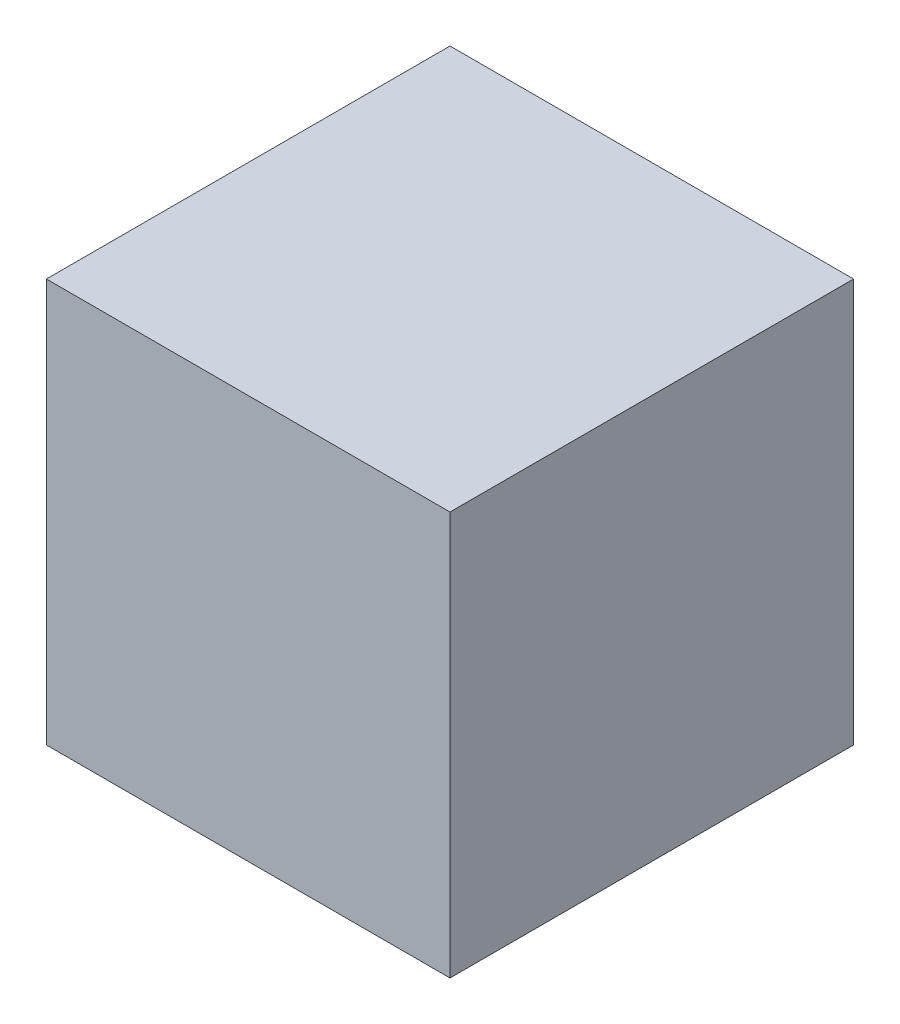
ISO-10303-21;
HEADER;
FILE_DESCRIPTION(('STEP AP214'),'2;1');
FILE_NAME('part.step','',(''),(''),'','','');
FILE_SCHEMA(('AUTOMOTIVE_DESIGN { 1 0 10303 214 1 1 1 1 }'));
ENDSEC;
DATA;
#1=APPLICATION_CONTEXT('core data for automotive mechanical design processes');
#2=APPLICATION_PROTOCOL_DEFINITION('international standard','automotive_design',2000,#1);
#3=PRODUCT_CONTEXT('',#1,'mechanical');
#4=PRODUCT('Part','Part','',(#3));
#5=PRODUCT_RELATED_PRODUCT_CATEGORY('part','',(#4));
#6=PRODUCT_DEFINITION_FORMATION('','',#4);
#7=PRODUCT_DEFINITION_CONTEXT('part definition',#1,'design');
#8=PRODUCT_DEFINITION('design','',#6,#7);
#9=PRODUCT_DEFINITION_SHAPE('','',#8);
#10=(LENGTH_UNIT() NAMED_UNIT(*) SI_UNIT(.MILLI.,.METRE.));
#11=(NAMED_UNIT(*) PLANE_ANGLE_UNIT() SI_UNIT($,.RADIAN.));
#12=(NAMED_UNIT(*) SI_UNIT($,.STERADIAN.) SOLID_ANGLE_UNIT());
#13=UNCERTAINTY_MEASURE_WITH_UNIT(LENGTH_MEASURE(1.E-05),#10,'distance_accuracy_value','');
#14=(GEOMETRIC_REPRESENTATION_CONTEXT(3) GLOBAL_UNCERTAINTY_ASSIGNED_CONTEXT((#13)) GLOBAL_UNIT_ASSIGNED_CONTEXT((#10,
#11,#12)) REPRESENTATION_CONTEXT('',''));
#15=CARTESIAN_POINT('',(0.,0.,0.));
#16=DIRECTION('',(0.,0.,1.));
#17=DIRECTION('',(1.,0.,0.));
#18=AXIS2_PLACEMENT_3D('',#15,#16,#17);
#19=CARTESIAN_POINT('',(28.5,-28.5,57.));
#20=DIRECTION('',(-1.,0.,0.));
#21=DIRECTION('',(0.,0.,1.));
#22=AXIS2_PLACEMENT_3D('',#19,#20,#21);
#23=PLANE('',#22);
#24=DIRECTION('',(0.,1.,0.));
#25=VECTOR('',#24,1.);
#26=CARTESIAN_POINT('',(28.5,-28.5,0.));
#27=LINE('',#26,#25);
#28=CARTESIAN_POINT('',(28.5,-28.5,0.));
#29=VERTEX_POINT('',#28);
#30=CARTESIAN_POINT('',(28.5,28.5,0.));
#31=VERTEX_POINT('',#30);
#32=EDGE_CURVE('E96',#29,#31,#27,.T.);
#33=ORIENTED_EDGE('',*,*,#32,.T.);
#34=DIRECTION('',(0.,0.,-1.));
#35=VECTOR('',#34,1.);
#36=CARTESIAN_POINT('',(28.5,28.5,57.));
#37=LINE('',#36,#35);
#38=CARTESIAN_POINT('',(28.5,28.5,57.));
#39=VERTEX_POINT('',#38);
#40=EDGE_CURVE('E11',#39,#31,#37,.T.);
#41=ORIENTED_EDGE('',*,*,#40,.F.);
#42=DIRECTION('',(0.,1.,0.));
#43=VECTOR('',#42,1.);
#44=CARTESIAN_POINT('',(28.5,-28.5,57.));
#45=LINE('',#44,#43);
#46=CARTESIAN_POINT('',(28.5,-28.5,57.));
#47=VERTEX_POINT('',#46);
#48=EDGE_CURVE('E84',#47,#39,#45,.T.);
#49=ORIENTED_EDGE('',*,*,#48,.F.);
#50=DIRECTION('',(0.,0.,-1.));
#51=VECTOR('',#50,1.);
#52=CARTESIAN_POINT('',(28.5,-28.5,57.));
#53=LINE('',#52,#51);
#54=EDGE_CURVE('E92',#47,#29,#53,.T.);
#55=ORIENTED_EDGE('',*,*,#54,.T.);
#56=EDGE_LOOP('',(#33,#41,#49,#55));
#57=FACE_BOUND('',#56,.T.);
#58=ADVANCED_FACE('F33',(#57),#23,.F.);
#59=CARTESIAN_POINT('',(-28.5,28.5,57.));
#60=DIRECTION('',(0.,-1.,0.));
#61=DIRECTION('',(0.,0.,-1.));
#62=AXIS2_PLACEMENT_3D('',#59,#60,#61);
#63=PLANE('',#62);
#64=DIRECTION('',(-1.,0.,0.));
#65=VECTOR('',#64,1.);
#66=CARTESIAN_POINT('',(-28.5,28.5,0.));
#67=LINE('',#66,#65);
#68=CARTESIAN_POINT('',(-28.5,28.5,0.));
#69=VERTEX_POINT('',#68);
#70=EDGE_CURVE('E88',#31,#69,#67,.T.);
#71=ORIENTED_EDGE('',*,*,#70,.T.);
#72=DIRECTION('',(0.,0.,-1.));
#73=VECTOR('',#72,1.);
#74=CARTESIAN_POINT('',(-28.5,28.5,57.));
#75=LINE('',#74,#73);
#76=CARTESIAN_POINT('',(-28.5,28.5,57.));
#77=VERTEX_POINT('',#76);
#78=EDGE_CURVE('E41',#77,#69,#75,.T.);
#79=ORIENTED_EDGE('',*,*,#78,.F.);
#80=DIRECTION('',(-1.,0.,0.));
#81=VECTOR('',#80,1.);
#82=CARTESIAN_POINT('',(-28.5,28.5,57.));
#83=LINE('',#82,#81);
#84=EDGE_CURVE('E79',#39,#77,#83,.T.);
#85=ORIENTED_EDGE('',*,*,#84,.F.);
#86=ORIENTED_EDGE('',*,*,#40,.T.);
#87=EDGE_LOOP('',(#71,#79,#85,#86));
#88=FACE_BOUND('',#87,.T.);
#89=ADVANCED_FACE('F87',(#88),#63,.F.);
#90=CARTESIAN_POINT('',(-28.5,-28.5,57.));
#91=DIRECTION('',(1.,0.,0.));
#92=DIRECTION('',(0.,0.,-1.));
#93=AXIS2_PLACEMENT_3D('',#90,#91,#92);
#94=PLANE('',#93);
#95=DIRECTION('',(0.,-1.,0.));
#96=VECTOR('',#95,1.);
#97=CARTESIAN_POINT('',(-28.5,-28.5,0.));
#98=LINE('',#97,#96);
#99=CARTESIAN_POINT('',(-28.5,-28.5,0.));
#100=VERTEX_POINT('',#99);
#101=EDGE_CURVE('E66',#69,#100,#98,.T.);
#102=ORIENTED_EDGE('',*,*,#101,.T.);
#103=DIRECTION('',(0.,0.,-1.));
#104=VECTOR('',#103,1.);
#105=CARTESIAN_POINT('',(-28.5,-28.5,57.));
#106=LINE('',#105,#104);
#107=CARTESIAN_POINT('',(-28.5,-28.5,57.));
#108=VERTEX_POINT('',#107);
#109=EDGE_CURVE('E89',#108,#100,#106,.T.);
#110=ORIENTED_EDGE('',*,*,#109,.F.);
#111=DIRECTION('',(0.,-1.,0.));
#112=VECTOR('',#111,1.);
#113=CARTESIAN_POINT('',(-28.5,-28.5,57.));
#114=LINE('',#113,#112);
#115=EDGE_CURVE('E82',#77,#108,#114,.T.);
#116=ORIENTED_EDGE('',*,*,#115,.F.);
#117=ORIENTED_EDGE('',*,*,#78,.T.);
#118=EDGE_LOOP('',(#102,#110,#116,#117));
#119=FACE_BOUND('',#118,.T.);
#120=ADVANCED_FACE('F90',(#119),#94,.F.);
#121=CARTESIAN_POINT('',(-28.5,-28.5,57.));
#122=DIRECTION('',(0.,1.,0.));
#123=DIRECTION('',(0.,0.,1.));
#124=AXIS2_PLACEMENT_3D('',#121,#122,#123);
#125=PLANE('',#124);
#126=DIRECTION('',(1.,0.,0.));
#127=VECTOR('',#126,1.);
#128=CARTESIAN_POINT('',(-28.5,-28.5,0.));
#129=LINE('',#128,#127);
#130=EDGE_CURVE('E72',#100,#29,#129,.T.);
#131=ORIENTED_EDGE('',*,*,#130,.T.);
#132=ORIENTED_EDGE('',*,*,#54,.F.);
#133=DIRECTION('',(1.,0.,0.));
#134=VECTOR('',#133,1.);
#135=CARTESIAN_POINT('',(-28.5,-28.5,57.));
#136=LINE('',#135,#134);
#137=EDGE_CURVE('E49',#108,#47,#136,.T.);
#138=ORIENTED_EDGE('',*,*,#137,.F.);
#139=ORIENTED_EDGE('',*,*,#109,.T.);
#140=EDGE_LOOP('',(#131,#132,#138,#139));
#141=FACE_BOUND('',#140,.T.);
#142=ADVANCED_FACE('F103',(#141),#125,.F.);
#143=CARTESIAN_POINT('',(0.,0.,57.));
#144=DIRECTION('',(0.,0.,-1.));
#145=DIRECTION('',(-1.,0.,0.));
#146=AXIS2_PLACEMENT_3D('',#143,#144,#145);
#147=PLANE('',#146);
#148=ORIENTED_EDGE('',*,*,#48,.T.);
#149=ORIENTED_EDGE('',*,*,#84,.T.);
#150=ORIENTED_EDGE('',*,*,#115,.T.);
#151=ORIENTED_EDGE('',*,*,#137,.T.);
#152=EDGE_LOOP('',(#148,#149,#150,#151));
#153=FACE_BOUND('',#152,.T.);
#154=ADVANCED_FACE('F80',(#153),#147,.F.);
#155=CARTESIAN_POINT('',(0.,0.,0.));
#156=DIRECTION('',(0.,0.,-1.));
#157=DIRECTION('',(-1.,0.,0.));
#158=AXIS2_PLACEMENT_3D('',#155,#156,#157);
#159=PLANE('',#158);
#160=ORIENTED_EDGE('',*,*,#32,.F.);
#161=ORIENTED_EDGE('',*,*,#130,.F.);
#162=ORIENTED_EDGE('',*,*,#101,.F.);
#163=ORIENTED_EDGE('',*,*,#70,.F.);
#164=EDGE_LOOP('',(#160,#161,#162,#163));
#165=FACE_BOUND('',#164,.T.);
#166=ADVANCED_FACE('F106',(#165),#159,.T.);
#167=CLOSED_SHELL('',(#58,#89,#120,#142,#154,#166));
#168=MANIFOLD_SOLID_BREP('B2',#167);
#169=ADVANCED_BREP_SHAPE_REPRESENTATION('',(#18,#168),#14);
#170=SHAPE_DEFINITION_REPRESENTATION(#9,#169);
ENDSEC;
END-ISO-10303-21;
